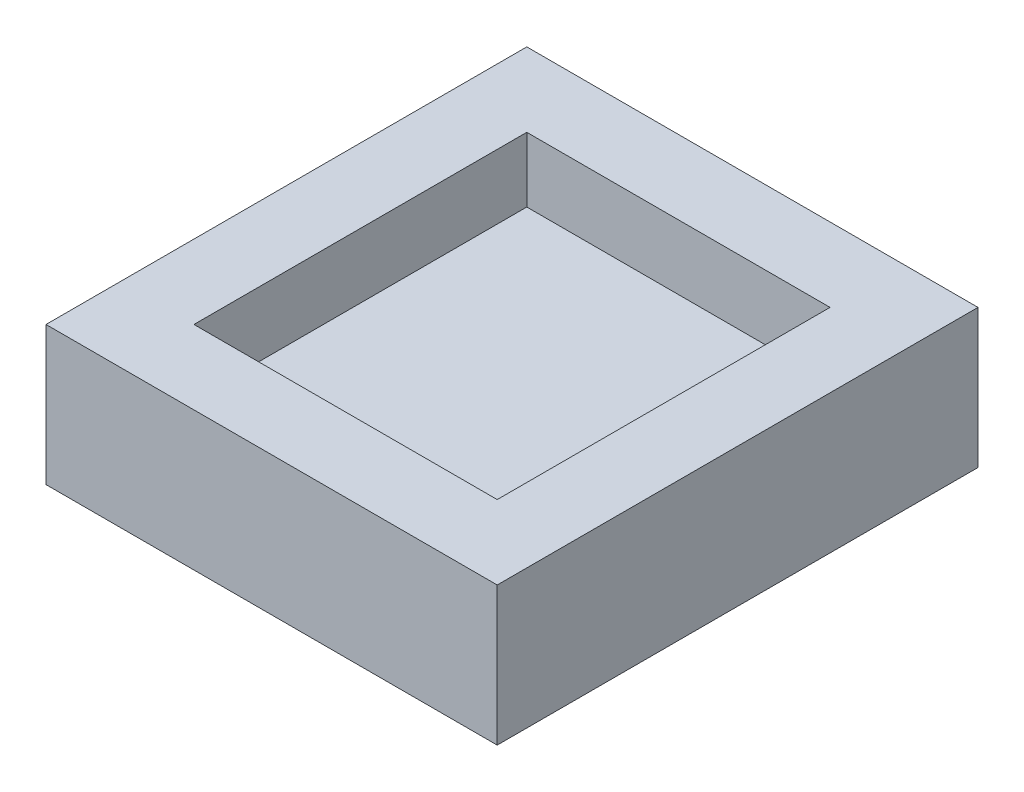
ISO-10303-21;
HEADER;
FILE_DESCRIPTION(('STEP AP214'),'2;1');
FILE_NAME('part.step','',(''),(''),'','','');
FILE_SCHEMA(('AUTOMOTIVE_DESIGN { 1 0 10303 214 1 1 1 1 }'));
ENDSEC;
DATA;
#1=APPLICATION_CONTEXT('core data for automotive mechanical design processes');
#2=APPLICATION_PROTOCOL_DEFINITION('international standard','automotive_design',2000,#1);
#3=PRODUCT_CONTEXT('',#1,'mechanical');
#4=PRODUCT('Part','Part','',(#3));
#5=PRODUCT_RELATED_PRODUCT_CATEGORY('part','',(#4));
#6=PRODUCT_DEFINITION_FORMATION('','',#4);
#7=PRODUCT_DEFINITION_CONTEXT('part definition',#1,'design');
#8=PRODUCT_DEFINITION('design','',#6,#7);
#9=PRODUCT_DEFINITION_SHAPE('','',#8);
#10=(LENGTH_UNIT() NAMED_UNIT(*) SI_UNIT(.MILLI.,.METRE.));
#11=(NAMED_UNIT(*) PLANE_ANGLE_UNIT() SI_UNIT($,.RADIAN.));
#12=(NAMED_UNIT(*) SI_UNIT($,.STERADIAN.) SOLID_ANGLE_UNIT());
#13=UNCERTAINTY_MEASURE_WITH_UNIT(LENGTH_MEASURE(1.E-05),#10,'distance_accuracy_value','');
#14=(GEOMETRIC_REPRESENTATION_CONTEXT(3) GLOBAL_UNCERTAINTY_ASSIGNED_CONTEXT((#13)) GLOBAL_UNIT_ASSIGNED_CONTEXT((#10,
#11,#12)) REPRESENTATION_CONTEXT('',''));
#15=CARTESIAN_POINT('',(0.,0.,0.));
#16=DIRECTION('',(0.,0.,1.));
#17=DIRECTION('',(1.,0.,0.));
#18=AXIS2_PLACEMENT_3D('',#15,#16,#17);
#19=CARTESIAN_POINT('',(30.5,18.75,32.5));
#20=DIRECTION('',(-1.,0.,0.));
#21=DIRECTION('',(0.,0.,1.));
#22=AXIS2_PLACEMENT_3D('',#19,#20,#21);
#23=PLANE('',#22);
#24=DIRECTION('',(0.,0.,-1.));
#25=VECTOR('',#24,1.);
#26=CARTESIAN_POINT('',(30.5,0.,32.5));
#27=LINE('',#26,#25);
#28=CARTESIAN_POINT('',(30.5,0.,32.5));
#29=VERTEX_POINT('',#28);
#30=CARTESIAN_POINT('',(30.5,0.,-32.5));
#31=VERTEX_POINT('',#30);
#32=EDGE_CURVE('E164',#29,#31,#27,.T.);
#33=ORIENTED_EDGE('',*,*,#32,.T.);
#34=DIRECTION('',(0.,-1.,0.));
#35=VECTOR('',#34,1.);
#36=CARTESIAN_POINT('',(30.5,18.75,-32.5));
#37=LINE('',#36,#35);
#38=CARTESIAN_POINT('',(30.5,18.75,-32.5));
#39=VERTEX_POINT('',#38);
#40=EDGE_CURVE('E11',#39,#31,#37,.T.);
#41=ORIENTED_EDGE('',*,*,#40,.F.);
#42=DIRECTION('',(0.,0.,-1.));
#43=VECTOR('',#42,1.);
#44=CARTESIAN_POINT('',(30.5,18.75,32.5));
#45=LINE('',#44,#43);
#46=CARTESIAN_POINT('',(30.5,18.75,32.5));
#47=VERTEX_POINT('',#46);
#48=EDGE_CURVE('E170',#47,#39,#45,.T.);
#49=ORIENTED_EDGE('',*,*,#48,.F.);
#50=DIRECTION('',(0.,-1.,0.));
#51=VECTOR('',#50,1.);
#52=CARTESIAN_POINT('',(30.5,18.75,32.5));
#53=LINE('',#52,#51);
#54=EDGE_CURVE('E180',#47,#29,#53,.T.);
#55=ORIENTED_EDGE('',*,*,#54,.T.);
#56=EDGE_LOOP('',(#33,#41,#49,#55));
#57=FACE_BOUND('',#56,.T.);
#58=ADVANCED_FACE('F45',(#57),#23,.F.);
#59=CARTESIAN_POINT('',(-30.5000000000001,18.75,-32.5));
#60=DIRECTION('',(0.,0.,1.));
#61=DIRECTION('',(1.,0.,0.));
#62=AXIS2_PLACEMENT_3D('',#59,#60,#61);
#63=PLANE('',#62);
#64=DIRECTION('',(-1.,0.,0.));
#65=VECTOR('',#64,1.);
#66=CARTESIAN_POINT('',(-30.5000000000001,0.,-32.5));
#67=LINE('',#66,#65);
#68=CARTESIAN_POINT('',(-30.5000000000001,0.,-32.5));
#69=VERTEX_POINT('',#68);
#70=EDGE_CURVE('E184',#31,#69,#67,.T.);
#71=ORIENTED_EDGE('',*,*,#70,.T.);
#72=DIRECTION('',(0.,-1.,0.));
#73=VECTOR('',#72,1.);
#74=CARTESIAN_POINT('',(-30.5000000000001,18.75,-32.5));
#75=LINE('',#74,#73);
#76=CARTESIAN_POINT('',(-30.5000000000001,18.75,-32.5));
#77=VERTEX_POINT('',#76);
#78=EDGE_CURVE('E53',#77,#69,#75,.T.);
#79=ORIENTED_EDGE('',*,*,#78,.F.);
#80=DIRECTION('',(-1.,0.,0.));
#81=VECTOR('',#80,1.);
#82=CARTESIAN_POINT('',(-30.5000000000001,18.75,-32.5));
#83=LINE('',#82,#81);
#84=EDGE_CURVE('E97',#39,#77,#83,.T.);
#85=ORIENTED_EDGE('',*,*,#84,.F.);
#86=ORIENTED_EDGE('',*,*,#40,.T.);
#87=EDGE_LOOP('',(#71,#79,#85,#86));
#88=FACE_BOUND('',#87,.T.);
#89=ADVANCED_FACE('F220',(#88),#63,.F.);
#90=CARTESIAN_POINT('',(-30.5000000000001,18.75,32.5));
#91=DIRECTION('',(1.,0.,0.));
#92=DIRECTION('',(0.,0.,-1.));
#93=AXIS2_PLACEMENT_3D('',#90,#91,#92);
#94=PLANE('',#93);
#95=DIRECTION('',(0.,0.,1.));
#96=VECTOR('',#95,1.);
#97=CARTESIAN_POINT('',(-30.5000000000001,0.,32.5));
#98=LINE('',#97,#96);
#99=CARTESIAN_POINT('',(-30.5000000000001,0.,32.5));
#100=VERTEX_POINT('',#99);
#101=EDGE_CURVE('E187',#69,#100,#98,.T.);
#102=ORIENTED_EDGE('',*,*,#101,.T.);
#103=DIRECTION('',(0.,-1.,0.));
#104=VECTOR('',#103,1.);
#105=CARTESIAN_POINT('',(-30.5000000000001,18.75,32.5));
#106=LINE('',#105,#104);
#107=CARTESIAN_POINT('',(-30.5000000000001,18.75,32.5));
#108=VERTEX_POINT('',#107);
#109=EDGE_CURVE('E194',#108,#100,#106,.T.);
#110=ORIENTED_EDGE('',*,*,#109,.F.);
#111=DIRECTION('',(0.,0.,1.));
#112=VECTOR('',#111,1.);
#113=CARTESIAN_POINT('',(-30.5000000000001,18.75,32.5));
#114=LINE('',#113,#112);
#115=EDGE_CURVE('E175',#77,#108,#114,.T.);
#116=ORIENTED_EDGE('',*,*,#115,.F.);
#117=ORIENTED_EDGE('',*,*,#78,.T.);
#118=EDGE_LOOP('',(#102,#110,#116,#117));
#119=FACE_BOUND('',#118,.T.);
#120=ADVANCED_FACE('F201',(#119),#94,.F.);
#121=CARTESIAN_POINT('',(-30.5000000000001,18.75,32.5));
#122=DIRECTION('',(0.,0.,-1.));
#123=DIRECTION('',(-1.,0.,0.));
#124=AXIS2_PLACEMENT_3D('',#121,#122,#123);
#125=PLANE('',#124);
#126=DIRECTION('',(1.,0.,0.));
#127=VECTOR('',#126,1.);
#128=CARTESIAN_POINT('',(-30.5000000000001,0.,32.5));
#129=LINE('',#128,#127);
#130=EDGE_CURVE('E90',#100,#29,#129,.T.);
#131=ORIENTED_EDGE('',*,*,#130,.T.);
#132=ORIENTED_EDGE('',*,*,#54,.F.);
#133=DIRECTION('',(1.,0.,0.));
#134=VECTOR('',#133,1.);
#135=CARTESIAN_POINT('',(-30.5000000000001,18.75,32.5));
#136=LINE('',#135,#134);
#137=EDGE_CURVE('E69',#108,#47,#136,.T.);
#138=ORIENTED_EDGE('',*,*,#137,.F.);
#139=ORIENTED_EDGE('',*,*,#109,.T.);
#140=EDGE_LOOP('',(#131,#132,#138,#139));
#141=FACE_BOUND('',#140,.T.);
#142=ADVANCED_FACE('F209',(#141),#125,.F.);
#143=CARTESIAN_POINT('',(0.,18.75,0.));
#144=DIRECTION('',(0.,-1.,0.));
#145=DIRECTION('',(0.,0.,-1.));
#146=AXIS2_PLACEMENT_3D('',#143,#144,#145);
#147=PLANE('',#146);
#148=DIRECTION('',(-1.,0.,0.));
#149=VECTOR('',#148,1.);
#150=CARTESIAN_POINT('',(-20.4999999999999,18.75,-22.5));
#151=LINE('',#150,#149);
#152=CARTESIAN_POINT('',(20.5,18.75,-22.5));
#153=VERTEX_POINT('',#152);
#154=CARTESIAN_POINT('',(-20.4999999999999,18.75,-22.5));
#155=VERTEX_POINT('',#154);
#156=EDGE_CURVE('E155',#153,#155,#151,.T.);
#157=ORIENTED_EDGE('',*,*,#156,.F.);
#158=DIRECTION('',(0.,0.,-1.));
#159=VECTOR('',#158,1.);
#160=CARTESIAN_POINT('',(20.5,18.75,-22.5));
#161=LINE('',#160,#159);
#162=CARTESIAN_POINT('',(20.5,18.75,22.5));
#163=VERTEX_POINT('',#162);
#164=EDGE_CURVE('E60',#163,#153,#161,.T.);
#165=ORIENTED_EDGE('',*,*,#164,.F.);
#166=DIRECTION('',(1.,0.,0.));
#167=VECTOR('',#166,1.);
#168=CARTESIAN_POINT('',(-20.4999999999999,18.75,22.5));
#169=LINE('',#168,#167);
#170=CARTESIAN_POINT('',(-20.4999999999999,18.75,22.5));
#171=VERTEX_POINT('',#170);
#172=EDGE_CURVE('E142',#171,#163,#169,.T.);
#173=ORIENTED_EDGE('',*,*,#172,.F.);
#174=DIRECTION('',(0.,0.,1.));
#175=VECTOR('',#174,1.);
#176=CARTESIAN_POINT('',(-20.4999999999999,18.75,-22.5));
#177=LINE('',#176,#175);
#178=EDGE_CURVE('E146',#155,#171,#177,.T.);
#179=ORIENTED_EDGE('',*,*,#178,.F.);
#180=EDGE_LOOP('',(#157,#165,#173,#179));
#181=FACE_BOUND('',#180,.T.);
#182=ORIENTED_EDGE('',*,*,#48,.T.);
#183=ORIENTED_EDGE('',*,*,#84,.T.);
#184=ORIENTED_EDGE('',*,*,#115,.T.);
#185=ORIENTED_EDGE('',*,*,#137,.T.);
#186=EDGE_LOOP('',(#182,#183,#184,#185));
#187=FACE_BOUND('',#186,.T.);
#188=ADVANCED_FACE('F211',(#181,#187),#147,.F.);
#189=CARTESIAN_POINT('',(0.,0.,0.));
#190=DIRECTION('',(0.,-1.,0.));
#191=DIRECTION('',(0.,0.,-1.));
#192=AXIS2_PLACEMENT_3D('',#189,#190,#191);
#193=PLANE('',#192);
#194=ORIENTED_EDGE('',*,*,#32,.F.);
#195=ORIENTED_EDGE('',*,*,#130,.F.);
#196=ORIENTED_EDGE('',*,*,#101,.F.);
#197=ORIENTED_EDGE('',*,*,#70,.F.);
#198=EDGE_LOOP('',(#194,#195,#196,#197));
#199=FACE_BOUND('',#198,.T.);
#200=ADVANCED_FACE('F205',(#199),#193,.T.);
#201=CARTESIAN_POINT('',(20.5,10.,-22.5));
#202=DIRECTION('',(1.,0.,0.));
#203=DIRECTION('',(0.,0.,-1.));
#204=AXIS2_PLACEMENT_3D('',#201,#202,#203);
#205=PLANE('',#204);
#206=ORIENTED_EDGE('',*,*,#164,.T.);
#207=DIRECTION('',(0.,1.,0.));
#208=VECTOR('',#207,1.);
#209=CARTESIAN_POINT('',(20.5,10.,-22.5));
#210=LINE('',#209,#208);
#211=CARTESIAN_POINT('',(20.5,10.,-22.5));
#212=VERTEX_POINT('',#211);
#213=EDGE_CURVE('E117',#212,#153,#210,.T.);
#214=ORIENTED_EDGE('',*,*,#213,.F.);
#215=DIRECTION('',(0.,0.,-1.));
#216=VECTOR('',#215,1.);
#217=CARTESIAN_POINT('',(20.5,10.,-22.5));
#218=LINE('',#217,#216);
#219=CARTESIAN_POINT('',(20.5,10.,22.5));
#220=VERTEX_POINT('',#219);
#221=EDGE_CURVE('E121',#220,#212,#218,.T.);
#222=ORIENTED_EDGE('',*,*,#221,.F.);
#223=DIRECTION('',(0.,1.,0.));
#224=VECTOR('',#223,1.);
#225=CARTESIAN_POINT('',(20.5,10.,22.5));
#226=LINE('',#225,#224);
#227=EDGE_CURVE('E161',#220,#163,#226,.T.);
#228=ORIENTED_EDGE('',*,*,#227,.T.);
#229=EDGE_LOOP('',(#206,#214,#222,#228));
#230=FACE_BOUND('',#229,.T.);
#231=ADVANCED_FACE('F119',(#230),#205,.F.);
#232=CARTESIAN_POINT('',(-20.4999999999999,10.,22.5));
#233=DIRECTION('',(0.,0.,1.));
#234=DIRECTION('',(1.,0.,0.));
#235=AXIS2_PLACEMENT_3D('',#232,#233,#234);
#236=PLANE('',#235);
#237=ORIENTED_EDGE('',*,*,#172,.T.);
#238=ORIENTED_EDGE('',*,*,#227,.F.);
#239=DIRECTION('',(1.,0.,0.));
#240=VECTOR('',#239,1.);
#241=CARTESIAN_POINT('',(-20.4999999999999,10.,22.5));
#242=LINE('',#241,#240);
#243=CARTESIAN_POINT('',(-20.4999999999999,10.,22.5));
#244=VERTEX_POINT('',#243);
#245=EDGE_CURVE('E128',#244,#220,#242,.T.);
#246=ORIENTED_EDGE('',*,*,#245,.F.);
#247=DIRECTION('',(0.,1.,0.));
#248=VECTOR('',#247,1.);
#249=CARTESIAN_POINT('',(-20.4999999999999,10.,22.5));
#250=LINE('',#249,#248);
#251=EDGE_CURVE('E165',#244,#171,#250,.T.);
#252=ORIENTED_EDGE('',*,*,#251,.T.);
#253=EDGE_LOOP('',(#237,#238,#246,#252));
#254=FACE_BOUND('',#253,.T.);
#255=ADVANCED_FACE('F260',(#254),#236,.F.);
#256=CARTESIAN_POINT('',(-20.4999999999999,10.,-22.5));
#257=DIRECTION('',(-1.,0.,0.));
#258=DIRECTION('',(0.,0.,1.));
#259=AXIS2_PLACEMENT_3D('',#256,#257,#258);
#260=PLANE('',#259);
#261=ORIENTED_EDGE('',*,*,#178,.T.);
#262=ORIENTED_EDGE('',*,*,#251,.F.);
#263=DIRECTION('',(0.,0.,1.));
#264=VECTOR('',#263,1.);
#265=CARTESIAN_POINT('',(-20.4999999999999,10.,-22.5));
#266=LINE('',#265,#264);
#267=CARTESIAN_POINT('',(-20.4999999999999,10.,-22.5));
#268=VERTEX_POINT('',#267);
#269=EDGE_CURVE('E137',#268,#244,#266,.T.);
#270=ORIENTED_EDGE('',*,*,#269,.F.);
#271=DIRECTION('',(0.,1.,0.));
#272=VECTOR('',#271,1.);
#273=CARTESIAN_POINT('',(-20.4999999999999,10.,-22.5));
#274=LINE('',#273,#272);
#275=EDGE_CURVE('E127',#268,#155,#274,.T.);
#276=ORIENTED_EDGE('',*,*,#275,.T.);
#277=EDGE_LOOP('',(#261,#262,#270,#276));
#278=FACE_BOUND('',#277,.T.);
#279=ADVANCED_FACE('F269',(#278),#260,.F.);
#280=CARTESIAN_POINT('',(-20.4999999999999,10.,-22.5));
#281=DIRECTION('',(0.,0.,-1.));
#282=DIRECTION('',(-1.,0.,0.));
#283=AXIS2_PLACEMENT_3D('',#280,#281,#282);
#284=PLANE('',#283);
#285=ORIENTED_EDGE('',*,*,#156,.T.);
#286=ORIENTED_EDGE('',*,*,#275,.F.);
#287=DIRECTION('',(-1.,0.,0.));
#288=VECTOR('',#287,1.);
#289=CARTESIAN_POINT('',(-20.4999999999999,10.,-22.5));
#290=LINE('',#289,#288);
#291=EDGE_CURVE('E131',#212,#268,#290,.T.);
#292=ORIENTED_EDGE('',*,*,#291,.F.);
#293=ORIENTED_EDGE('',*,*,#213,.T.);
#294=EDGE_LOOP('',(#285,#286,#292,#293));
#295=FACE_BOUND('',#294,.T.);
#296=ADVANCED_FACE('F132',(#295),#284,.F.);
#297=CARTESIAN_POINT('',(0.,10.,0.));
#298=DIRECTION('',(0.,1.,0.));
#299=DIRECTION('',(0.,0.,1.));
#300=AXIS2_PLACEMENT_3D('',#297,#298,#299);
#301=PLANE('',#300);
#302=ORIENTED_EDGE('',*,*,#221,.T.);
#303=ORIENTED_EDGE('',*,*,#291,.T.);
#304=ORIENTED_EDGE('',*,*,#269,.T.);
#305=ORIENTED_EDGE('',*,*,#245,.T.);
#306=EDGE_LOOP('',(#302,#303,#304,#305));
#307=FACE_BOUND('',#306,.T.);
#308=ADVANCED_FACE('F139',(#307),#301,.T.);
#309=CLOSED_SHELL('',(#58,#89,#120,#142,#188,#200,#231,#255,#279,#296,#308));
#310=MANIFOLD_SOLID_BREP('B2',#309);
#311=ADVANCED_BREP_SHAPE_REPRESENTATION('',(#18,#310),#14);
#312=SHAPE_DEFINITION_REPRESENTATION(#9,#311);
ENDSEC;
END-ISO-10303-21;
